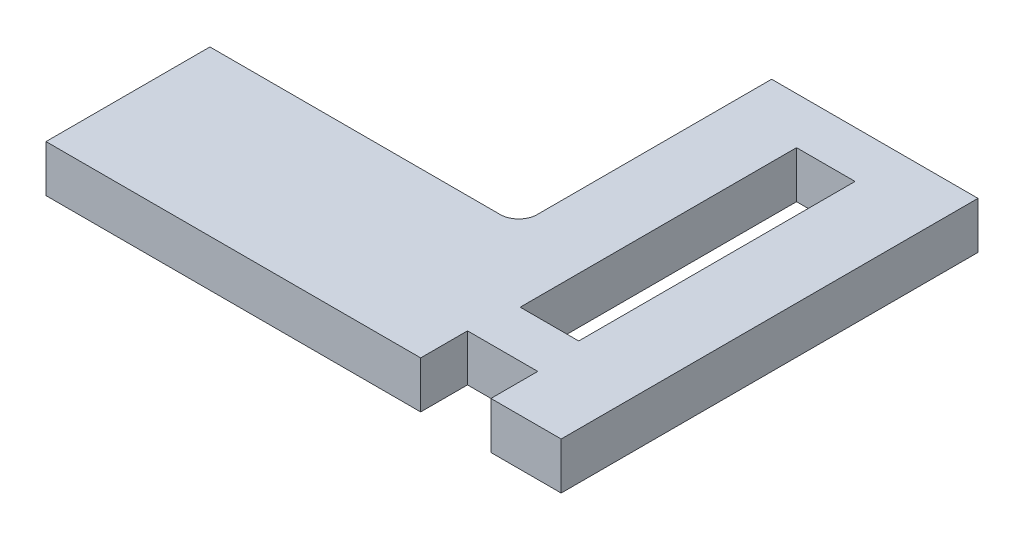
ISO-10303-21;
HEADER;
FILE_DESCRIPTION(('STEP AP214'),'2;1');
FILE_NAME('part.step','',(''),(''),'','','');
FILE_SCHEMA(('AUTOMOTIVE_DESIGN { 1 0 10303 214 1 1 1 1 }'));
ENDSEC;
DATA;
#1=APPLICATION_CONTEXT('core data for automotive mechanical design processes');
#2=APPLICATION_PROTOCOL_DEFINITION('international standard','automotive_design',2000,#1);
#3=PRODUCT_CONTEXT('',#1,'mechanical');
#4=PRODUCT('Part','Part','',(#3));
#5=PRODUCT_RELATED_PRODUCT_CATEGORY('part','',(#4));
#6=PRODUCT_DEFINITION_FORMATION('','',#4);
#7=PRODUCT_DEFINITION_CONTEXT('part definition',#1,'design');
#8=PRODUCT_DEFINITION('design','',#6,#7);
#9=PRODUCT_DEFINITION_SHAPE('','',#8);
#10=(LENGTH_UNIT() NAMED_UNIT(*) SI_UNIT(.MILLI.,.METRE.));
#11=(NAMED_UNIT(*) PLANE_ANGLE_UNIT() SI_UNIT($,.RADIAN.));
#12=(NAMED_UNIT(*) SI_UNIT($,.STERADIAN.) SOLID_ANGLE_UNIT());
#13=UNCERTAINTY_MEASURE_WITH_UNIT(LENGTH_MEASURE(1.E-05),#10,'distance_accuracy_value','');
#14=(GEOMETRIC_REPRESENTATION_CONTEXT(3) GLOBAL_UNCERTAINTY_ASSIGNED_CONTEXT((#13)) GLOBAL_UNIT_ASSIGNED_CONTEXT((#10,
#11,#12)) REPRESENTATION_CONTEXT('',''));
#15=CARTESIAN_POINT('',(0.,0.,0.));
#16=DIRECTION('',(0.,0.,1.));
#17=DIRECTION('',(1.,0.,0.));
#18=AXIS2_PLACEMENT_3D('',#15,#16,#17);
#19=CARTESIAN_POINT('',(157.48,25.4,-98.9));
#20=DIRECTION('',(0.,1.,0.));
#21=DIRECTION('',(0.,0.,1.));
#22=AXIS2_PLACEMENT_3D('',#19,#20,#21);
#23=PLANE('',#22);
#24=DIRECTION('',(0.,0.,-1.));
#25=VECTOR('',#24,1.);
#26=CARTESIAN_POINT('',(0.,25.4,0.));
#27=LINE('',#26,#25);
#28=CARTESIAN_POINT('',(0.,25.4,0.));
#29=VERTEX_POINT('',#28);
#30=CARTESIAN_POINT('',(0.,25.4,-88.9));
#31=VERTEX_POINT('',#30);
#32=EDGE_CURVE('E221',#29,#31,#27,.T.);
#33=ORIENTED_EDGE('',*,*,#32,.F.);
#34=DIRECTION('',(-1.,0.,0.));
#35=VECTOR('',#34,1.);
#36=CARTESIAN_POINT('',(203.2,25.4,0.));
#37=LINE('',#36,#35);
#38=CARTESIAN_POINT('',(203.2,25.4,0.));
#39=VERTEX_POINT('',#38);
#40=EDGE_CURVE('E252',#39,#29,#37,.T.);
#41=ORIENTED_EDGE('',*,*,#40,.F.);
#42=DIRECTION('',(0.,0.,1.));
#43=VECTOR('',#42,1.);
#44=CARTESIAN_POINT('',(203.2,25.4,-25.4));
#45=LINE('',#44,#43);
#46=CARTESIAN_POINT('',(203.2,25.4,-25.4));
#47=VERTEX_POINT('',#46);
#48=EDGE_CURVE('E249',#47,#39,#45,.T.);
#49=ORIENTED_EDGE('',*,*,#48,.F.);
#50=DIRECTION('',(-1.,0.,0.));
#51=VECTOR('',#50,1.);
#52=CARTESIAN_POINT('',(241.3,25.4,-25.4));
#53=LINE('',#52,#51);
#54=CARTESIAN_POINT('',(241.3,25.4,-25.4));
#55=VERTEX_POINT('',#54);
#56=EDGE_CURVE('E246',#55,#47,#53,.T.);
#57=ORIENTED_EDGE('',*,*,#56,.F.);
#58=DIRECTION('',(0.,0.,-1.));
#59=VECTOR('',#58,1.);
#60=CARTESIAN_POINT('',(241.3,25.4,0.));
#61=LINE('',#60,#59);
#62=CARTESIAN_POINT('',(241.3,25.4,0.));
#63=VERTEX_POINT('',#62);
#64=EDGE_CURVE('E243',#63,#55,#61,.T.);
#65=ORIENTED_EDGE('',*,*,#64,.F.);
#66=DIRECTION('',(-1.,0.,0.));
#67=VECTOR('',#66,1.);
#68=CARTESIAN_POINT('',(279.4,25.4,0.));
#69=LINE('',#68,#67);
#70=CARTESIAN_POINT('',(279.4,25.4,0.));
#71=VERTEX_POINT('',#70);
#72=EDGE_CURVE('E240',#71,#63,#69,.T.);
#73=ORIENTED_EDGE('',*,*,#72,.F.);
#74=DIRECTION('',(0.,0.,1.));
#75=VECTOR('',#74,1.);
#76=CARTESIAN_POINT('',(279.4,25.4,-226.06));
#77=LINE('',#76,#75);
#78=CARTESIAN_POINT('',(279.4,25.4,-226.06));
#79=VERTEX_POINT('',#78);
#80=EDGE_CURVE('E237',#79,#71,#77,.T.);
#81=ORIENTED_EDGE('',*,*,#80,.F.);
#82=DIRECTION('',(1.,0.,0.));
#83=VECTOR('',#82,1.);
#84=CARTESIAN_POINT('',(167.48,25.4,-226.06));
#85=LINE('',#84,#83);
#86=CARTESIAN_POINT('',(167.48,25.4,-226.06));
#87=VERTEX_POINT('',#86);
#88=EDGE_CURVE('E234',#87,#79,#85,.T.);
#89=ORIENTED_EDGE('',*,*,#88,.F.);
#90=DIRECTION('',(0.,0.,-1.));
#91=VECTOR('',#90,1.);
#92=CARTESIAN_POINT('',(167.48,25.4,-98.9));
#93=LINE('',#92,#91);
#94=CARTESIAN_POINT('',(167.48,25.4,-98.9));
#95=VERTEX_POINT('',#94);
#96=EDGE_CURVE('E231',#95,#87,#93,.T.);
#97=ORIENTED_EDGE('',*,*,#96,.F.);
#98=CARTESIAN_POINT('',(157.48,25.4,-98.9));
#99=DIRECTION('',(0.,1.,0.));
#100=DIRECTION('',(0.,0.,1.));
#101=AXIS2_PLACEMENT_3D('',#98,#99,#100);
#102=CIRCLE('',#101,10.);
#103=CARTESIAN_POINT('',(157.48,25.4,-88.9));
#104=VERTEX_POINT('',#103);
#105=EDGE_CURVE('E228',#104,#95,#102,.T.);
#106=ORIENTED_EDGE('',*,*,#105,.F.);
#107=DIRECTION('',(1.,0.,0.));
#108=VECTOR('',#107,1.);
#109=CARTESIAN_POINT('',(0.,25.4,-88.9));
#110=LINE('',#109,#108);
#111=EDGE_CURVE('E224',#31,#104,#110,.T.);
#112=ORIENTED_EDGE('',*,*,#111,.F.);
#113=EDGE_LOOP('',(#33,#41,#49,#57,#65,#73,#81,#89,#97,#106,#112));
#114=FACE_BOUND('',#113,.T.);
#115=DIRECTION('',(0.,0.,-1.));
#116=VECTOR('',#115,1.);
#117=CARTESIAN_POINT('',(238.121360741701,25.4,-50.8));
#118=LINE('',#117,#116);
#119=CARTESIAN_POINT('',(238.121360741701,25.4,-50.8));
#120=VERTEX_POINT('',#119);
#121=CARTESIAN_POINT('',(238.121360741701,25.4,-200.66));
#122=VERTEX_POINT('',#121);
#123=EDGE_CURVE('E195',#120,#122,#118,.T.);
#124=ORIENTED_EDGE('',*,*,#123,.F.);
#125=DIRECTION('',(1.,0.,0.));
#126=VECTOR('',#125,1.);
#127=CARTESIAN_POINT('',(206.378639258299,25.4,-50.8));
#128=LINE('',#127,#126);
#129=CARTESIAN_POINT('',(206.378639258299,25.4,-50.8));
#130=VERTEX_POINT('',#129);
#131=EDGE_CURVE('E186',#130,#120,#128,.T.);
#132=ORIENTED_EDGE('',*,*,#131,.F.);
#133=DIRECTION('',(0.,0.,-1.));
#134=VECTOR('',#133,1.);
#135=CARTESIAN_POINT('',(206.378639258299,25.4,-50.8));
#136=LINE('',#135,#134);
#137=CARTESIAN_POINT('',(206.378639258299,25.4,-200.66));
#138=VERTEX_POINT('',#137);
#139=EDGE_CURVE('E206',#130,#138,#136,.T.);
#140=ORIENTED_EDGE('',*,*,#139,.T.);
#141=DIRECTION('',(1.,0.,0.));
#142=VECTOR('',#141,1.);
#143=CARTESIAN_POINT('',(206.378639258299,25.4,-200.66));
#144=LINE('',#143,#142);
#145=EDGE_CURVE('E95',#138,#122,#144,.T.);
#146=ORIENTED_EDGE('',*,*,#145,.T.);
#147=EDGE_LOOP('',(#124,#132,#140,#146));
#148=FACE_BOUND('',#147,.T.);
#149=ADVANCED_FACE('F78',(#114,#148),#23,.T.);
#150=CARTESIAN_POINT('',(157.48,0.,-98.9));
#151=DIRECTION('',(0.,1.,0.));
#152=DIRECTION('',(0.,0.,1.));
#153=AXIS2_PLACEMENT_3D('',#150,#151,#152);
#154=PLANE('',#153);
#155=DIRECTION('',(0.,0.,-1.));
#156=VECTOR('',#155,1.);
#157=CARTESIAN_POINT('',(0.,0.,0.));
#158=LINE('',#157,#156);
#159=CARTESIAN_POINT('',(0.,0.,0.));
#160=VERTEX_POINT('',#159);
#161=CARTESIAN_POINT('',(0.,0.,-88.9));
#162=VERTEX_POINT('',#161);
#163=EDGE_CURVE('E202',#160,#162,#158,.T.);
#164=ORIENTED_EDGE('',*,*,#163,.T.);
#165=DIRECTION('',(1.,0.,0.));
#166=VECTOR('',#165,1.);
#167=CARTESIAN_POINT('',(0.,0.,-88.9));
#168=LINE('',#167,#166);
#169=CARTESIAN_POINT('',(157.48,0.,-88.9));
#170=VERTEX_POINT('',#169);
#171=EDGE_CURVE('E257',#162,#170,#168,.T.);
#172=ORIENTED_EDGE('',*,*,#171,.T.);
#173=CARTESIAN_POINT('',(157.48,0.,-98.9));
#174=DIRECTION('',(0.,1.,0.));
#175=DIRECTION('',(0.,0.,1.));
#176=AXIS2_PLACEMENT_3D('',#173,#174,#175);
#177=CIRCLE('',#176,10.);
#178=CARTESIAN_POINT('',(167.48,0.,-98.9));
#179=VERTEX_POINT('',#178);
#180=EDGE_CURVE('E260',#170,#179,#177,.T.);
#181=ORIENTED_EDGE('',*,*,#180,.T.);
#182=DIRECTION('',(0.,0.,-1.));
#183=VECTOR('',#182,1.);
#184=CARTESIAN_POINT('',(167.48,0.,-98.9));
#185=LINE('',#184,#183);
#186=CARTESIAN_POINT('',(167.48,0.,-226.06));
#187=VERTEX_POINT('',#186);
#188=EDGE_CURVE('E263',#179,#187,#185,.T.);
#189=ORIENTED_EDGE('',*,*,#188,.T.);
#190=DIRECTION('',(1.,0.,0.));
#191=VECTOR('',#190,1.);
#192=CARTESIAN_POINT('',(167.48,0.,-226.06));
#193=LINE('',#192,#191);
#194=CARTESIAN_POINT('',(279.4,0.,-226.06));
#195=VERTEX_POINT('',#194);
#196=EDGE_CURVE('E266',#187,#195,#193,.T.);
#197=ORIENTED_EDGE('',*,*,#196,.T.);
#198=DIRECTION('',(0.,0.,1.));
#199=VECTOR('',#198,1.);
#200=CARTESIAN_POINT('',(279.4,0.,-226.06));
#201=LINE('',#200,#199);
#202=CARTESIAN_POINT('',(279.4,0.,0.));
#203=VERTEX_POINT('',#202);
#204=EDGE_CURVE('E269',#195,#203,#201,.T.);
#205=ORIENTED_EDGE('',*,*,#204,.T.);
#206=DIRECTION('',(-1.,0.,0.));
#207=VECTOR('',#206,1.);
#208=CARTESIAN_POINT('',(279.4,0.,0.));
#209=LINE('',#208,#207);
#210=CARTESIAN_POINT('',(241.3,0.,0.));
#211=VERTEX_POINT('',#210);
#212=EDGE_CURVE('E272',#203,#211,#209,.T.);
#213=ORIENTED_EDGE('',*,*,#212,.T.);
#214=DIRECTION('',(0.,0.,-1.));
#215=VECTOR('',#214,1.);
#216=CARTESIAN_POINT('',(241.3,0.,0.));
#217=LINE('',#216,#215);
#218=CARTESIAN_POINT('',(241.3,0.,-25.4));
#219=VERTEX_POINT('',#218);
#220=EDGE_CURVE('E275',#211,#219,#217,.T.);
#221=ORIENTED_EDGE('',*,*,#220,.T.);
#222=DIRECTION('',(-1.,0.,0.));
#223=VECTOR('',#222,1.);
#224=CARTESIAN_POINT('',(241.3,0.,-25.4));
#225=LINE('',#224,#223);
#226=CARTESIAN_POINT('',(203.2,0.,-25.4));
#227=VERTEX_POINT('',#226);
#228=EDGE_CURVE('E278',#219,#227,#225,.T.);
#229=ORIENTED_EDGE('',*,*,#228,.T.);
#230=DIRECTION('',(0.,0.,1.));
#231=VECTOR('',#230,1.);
#232=CARTESIAN_POINT('',(203.2,0.,-25.4));
#233=LINE('',#232,#231);
#234=CARTESIAN_POINT('',(203.2,0.,0.));
#235=VERTEX_POINT('',#234);
#236=EDGE_CURVE('E281',#227,#235,#233,.T.);
#237=ORIENTED_EDGE('',*,*,#236,.T.);
#238=DIRECTION('',(-1.,0.,0.));
#239=VECTOR('',#238,1.);
#240=CARTESIAN_POINT('',(203.2,0.,0.));
#241=LINE('',#240,#239);
#242=EDGE_CURVE('E225',#235,#160,#241,.T.);
#243=ORIENTED_EDGE('',*,*,#242,.T.);
#244=EDGE_LOOP('',(#164,#172,#181,#189,#197,#205,#213,#221,#229,#237,#243));
#245=FACE_BOUND('',#244,.T.);
#246=DIRECTION('',(1.,0.,0.));
#247=VECTOR('',#246,1.);
#248=CARTESIAN_POINT('',(206.378639258299,0.,-50.8));
#249=LINE('',#248,#247);
#250=CARTESIAN_POINT('',(206.378639258299,0.,-50.8));
#251=VERTEX_POINT('',#250);
#252=CARTESIAN_POINT('',(238.121360741701,0.,-50.8));
#253=VERTEX_POINT('',#252);
#254=EDGE_CURVE('E103',#251,#253,#249,.T.);
#255=ORIENTED_EDGE('',*,*,#254,.T.);
#256=DIRECTION('',(0.,0.,-1.));
#257=VECTOR('',#256,1.);
#258=CARTESIAN_POINT('',(238.121360741701,0.,-50.8));
#259=LINE('',#258,#257);
#260=CARTESIAN_POINT('',(238.121360741701,0.,-200.66));
#261=VERTEX_POINT('',#260);
#262=EDGE_CURVE('E201',#253,#261,#259,.T.);
#263=ORIENTED_EDGE('',*,*,#262,.T.);
#264=DIRECTION('',(1.,0.,0.));
#265=VECTOR('',#264,1.);
#266=CARTESIAN_POINT('',(206.378639258299,0.,-200.66));
#267=LINE('',#266,#265);
#268=CARTESIAN_POINT('',(206.378639258299,0.,-200.66));
#269=VERTEX_POINT('',#268);
#270=EDGE_CURVE('E212',#269,#261,#267,.T.);
#271=ORIENTED_EDGE('',*,*,#270,.F.);
#272=DIRECTION('',(0.,0.,-1.));
#273=VECTOR('',#272,1.);
#274=CARTESIAN_POINT('',(206.378639258299,0.,-50.8));
#275=LINE('',#274,#273);
#276=EDGE_CURVE('E196',#251,#269,#275,.T.);
#277=ORIENTED_EDGE('',*,*,#276,.F.);
#278=EDGE_LOOP('',(#255,#263,#271,#277));
#279=FACE_BOUND('',#278,.T.);
#280=ADVANCED_FACE('F310',(#245,#279),#154,.F.);
#281=CARTESIAN_POINT('',(0.,25.4,0.));
#282=DIRECTION('',(-1.,0.,0.));
#283=DIRECTION('',(0.,0.,1.));
#284=AXIS2_PLACEMENT_3D('',#281,#282,#283);
#285=PLANE('',#284);
#286=ORIENTED_EDGE('',*,*,#163,.F.);
#287=DIRECTION('',(0.,-1.,0.));
#288=VECTOR('',#287,1.);
#289=CARTESIAN_POINT('',(0.,25.4,0.));
#290=LINE('',#289,#288);
#291=EDGE_CURVE('E12',#29,#160,#290,.T.);
#292=ORIENTED_EDGE('',*,*,#291,.F.);
#293=ORIENTED_EDGE('',*,*,#32,.T.);
#294=DIRECTION('',(0.,-1.,0.));
#295=VECTOR('',#294,1.);
#296=CARTESIAN_POINT('',(0.,25.4,-88.9));
#297=LINE('',#296,#295);
#298=EDGE_CURVE('E82',#31,#162,#297,.T.);
#299=ORIENTED_EDGE('',*,*,#298,.T.);
#300=EDGE_LOOP('',(#286,#292,#293,#299));
#301=FACE_BOUND('',#300,.T.);
#302=ADVANCED_FACE('F80',(#301),#285,.T.);
#303=CARTESIAN_POINT('',(203.2,25.4,0.));
#304=DIRECTION('',(0.,0.,1.));
#305=DIRECTION('',(1.,0.,0.));
#306=AXIS2_PLACEMENT_3D('',#303,#304,#305);
#307=PLANE('',#306);
#308=ORIENTED_EDGE('',*,*,#242,.F.);
#309=DIRECTION('',(0.,-1.,0.));
#310=VECTOR('',#309,1.);
#311=CARTESIAN_POINT('',(203.2,25.4,0.));
#312=LINE('',#311,#310);
#313=EDGE_CURVE('E87',#39,#235,#312,.T.);
#314=ORIENTED_EDGE('',*,*,#313,.F.);
#315=ORIENTED_EDGE('',*,*,#40,.T.);
#316=ORIENTED_EDGE('',*,*,#291,.T.);
#317=EDGE_LOOP('',(#308,#314,#315,#316));
#318=FACE_BOUND('',#317,.T.);
#319=ADVANCED_FACE('F315',(#318),#307,.T.);
#320=CARTESIAN_POINT('',(203.2,25.4,-25.4));
#321=DIRECTION('',(1.,0.,0.));
#322=DIRECTION('',(0.,0.,-1.));
#323=AXIS2_PLACEMENT_3D('',#320,#321,#322);
#324=PLANE('',#323);
#325=ORIENTED_EDGE('',*,*,#236,.F.);
#326=DIRECTION('',(0.,-1.,0.));
#327=VECTOR('',#326,1.);
#328=CARTESIAN_POINT('',(203.2,25.4,-25.4));
#329=LINE('',#328,#327);
#330=EDGE_CURVE('E287',#47,#227,#329,.T.);
#331=ORIENTED_EDGE('',*,*,#330,.F.);
#332=ORIENTED_EDGE('',*,*,#48,.T.);
#333=ORIENTED_EDGE('',*,*,#313,.T.);
#334=EDGE_LOOP('',(#325,#331,#332,#333));
#335=FACE_BOUND('',#334,.T.);
#336=ADVANCED_FACE('F347',(#335),#324,.T.);
#337=CARTESIAN_POINT('',(241.3,25.4,-25.4));
#338=DIRECTION('',(0.,0.,1.));
#339=DIRECTION('',(1.,0.,0.));
#340=AXIS2_PLACEMENT_3D('',#337,#338,#339);
#341=PLANE('',#340);
#342=ORIENTED_EDGE('',*,*,#228,.F.);
#343=DIRECTION('',(0.,-1.,0.));
#344=VECTOR('',#343,1.);
#345=CARTESIAN_POINT('',(241.3,25.4,-25.4));
#346=LINE('',#345,#344);
#347=EDGE_CURVE('E289',#55,#219,#346,.T.);
#348=ORIENTED_EDGE('',*,*,#347,.F.);
#349=ORIENTED_EDGE('',*,*,#56,.T.);
#350=ORIENTED_EDGE('',*,*,#330,.T.);
#351=EDGE_LOOP('',(#342,#348,#349,#350));
#352=FACE_BOUND('',#351,.T.);
#353=ADVANCED_FACE('F345',(#352),#341,.T.);
#354=CARTESIAN_POINT('',(241.3,25.4,0.));
#355=DIRECTION('',(-1.,0.,0.));
#356=DIRECTION('',(0.,0.,1.));
#357=AXIS2_PLACEMENT_3D('',#354,#355,#356);
#358=PLANE('',#357);
#359=ORIENTED_EDGE('',*,*,#220,.F.);
#360=DIRECTION('',(0.,-1.,0.));
#361=VECTOR('',#360,1.);
#362=CARTESIAN_POINT('',(241.3,25.4,0.));
#363=LINE('',#362,#361);
#364=EDGE_CURVE('E291',#63,#211,#363,.T.);
#365=ORIENTED_EDGE('',*,*,#364,.F.);
#366=ORIENTED_EDGE('',*,*,#64,.T.);
#367=ORIENTED_EDGE('',*,*,#347,.T.);
#368=EDGE_LOOP('',(#359,#365,#366,#367));
#369=FACE_BOUND('',#368,.T.);
#370=ADVANCED_FACE('F341',(#369),#358,.T.);
#371=CARTESIAN_POINT('',(279.4,25.4,0.));
#372=DIRECTION('',(0.,0.,1.));
#373=DIRECTION('',(1.,0.,0.));
#374=AXIS2_PLACEMENT_3D('',#371,#372,#373);
#375=PLANE('',#374);
#376=ORIENTED_EDGE('',*,*,#212,.F.);
#377=DIRECTION('',(0.,-1.,0.));
#378=VECTOR('',#377,1.);
#379=CARTESIAN_POINT('',(279.4,25.4,0.));
#380=LINE('',#379,#378);
#381=EDGE_CURVE('E293',#71,#203,#380,.T.);
#382=ORIENTED_EDGE('',*,*,#381,.F.);
#383=ORIENTED_EDGE('',*,*,#72,.T.);
#384=ORIENTED_EDGE('',*,*,#364,.T.);
#385=EDGE_LOOP('',(#376,#382,#383,#384));
#386=FACE_BOUND('',#385,.T.);
#387=ADVANCED_FACE('F337',(#386),#375,.T.);
#388=CARTESIAN_POINT('',(279.4,25.4,-226.06));
#389=DIRECTION('',(1.,0.,0.));
#390=DIRECTION('',(0.,0.,-1.));
#391=AXIS2_PLACEMENT_3D('',#388,#389,#390);
#392=PLANE('',#391);
#393=ORIENTED_EDGE('',*,*,#204,.F.);
#394=DIRECTION('',(0.,-1.,0.));
#395=VECTOR('',#394,1.);
#396=CARTESIAN_POINT('',(279.4,25.4,-226.06));
#397=LINE('',#396,#395);
#398=EDGE_CURVE('E295',#79,#195,#397,.T.);
#399=ORIENTED_EDGE('',*,*,#398,.F.);
#400=ORIENTED_EDGE('',*,*,#80,.T.);
#401=ORIENTED_EDGE('',*,*,#381,.T.);
#402=EDGE_LOOP('',(#393,#399,#400,#401));
#403=FACE_BOUND('',#402,.T.);
#404=ADVANCED_FACE('F333',(#403),#392,.T.);
#405=CARTESIAN_POINT('',(167.48,25.4,-226.06));
#406=DIRECTION('',(0.,0.,-1.));
#407=DIRECTION('',(-1.,0.,0.));
#408=AXIS2_PLACEMENT_3D('',#405,#406,#407);
#409=PLANE('',#408);
#410=ORIENTED_EDGE('',*,*,#196,.F.);
#411=DIRECTION('',(0.,-1.,0.));
#412=VECTOR('',#411,1.);
#413=CARTESIAN_POINT('',(167.48,25.4,-226.06));
#414=LINE('',#413,#412);
#415=EDGE_CURVE('E297',#87,#187,#414,.T.);
#416=ORIENTED_EDGE('',*,*,#415,.F.);
#417=ORIENTED_EDGE('',*,*,#88,.T.);
#418=ORIENTED_EDGE('',*,*,#398,.T.);
#419=EDGE_LOOP('',(#410,#416,#417,#418));
#420=FACE_BOUND('',#419,.T.);
#421=ADVANCED_FACE('F329',(#420),#409,.T.);
#422=CARTESIAN_POINT('',(167.48,25.4,-98.9));
#423=DIRECTION('',(-1.,0.,0.));
#424=DIRECTION('',(0.,0.,1.));
#425=AXIS2_PLACEMENT_3D('',#422,#423,#424);
#426=PLANE('',#425);
#427=ORIENTED_EDGE('',*,*,#188,.F.);
#428=DIRECTION('',(0.,-1.,0.));
#429=VECTOR('',#428,1.);
#430=CARTESIAN_POINT('',(167.48,25.4,-98.9));
#431=LINE('',#430,#429);
#432=EDGE_CURVE('E299',#95,#179,#431,.T.);
#433=ORIENTED_EDGE('',*,*,#432,.F.);
#434=ORIENTED_EDGE('',*,*,#96,.T.);
#435=ORIENTED_EDGE('',*,*,#415,.T.);
#436=EDGE_LOOP('',(#427,#433,#434,#435));
#437=FACE_BOUND('',#436,.T.);
#438=ADVANCED_FACE('F327',(#437),#426,.T.);
#439=CARTESIAN_POINT('',(157.48,25.4,-98.9));
#440=DIRECTION('',(0.,-1.,0.));
#441=DIRECTION('',(0.,0.,-1.));
#442=AXIS2_PLACEMENT_3D('',#439,#440,#441);
#443=CYLINDRICAL_SURFACE('',#442,10.);
#444=ORIENTED_EDGE('',*,*,#180,.F.);
#445=DIRECTION('',(0.,-1.,0.));
#446=VECTOR('',#445,1.);
#447=CARTESIAN_POINT('',(157.48,25.4,-88.9));
#448=LINE('',#447,#446);
#449=EDGE_CURVE('E300',#104,#170,#448,.T.);
#450=ORIENTED_EDGE('',*,*,#449,.F.);
#451=ORIENTED_EDGE('',*,*,#105,.T.);
#452=ORIENTED_EDGE('',*,*,#432,.T.);
#453=EDGE_LOOP('',(#444,#450,#451,#452));
#454=FACE_BOUND('',#453,.T.);
#455=ADVANCED_FACE('F323',(#454),#443,.F.);
#456=CARTESIAN_POINT('',(0.,25.4,-88.9));
#457=DIRECTION('',(0.,0.,-1.));
#458=DIRECTION('',(-1.,0.,0.));
#459=AXIS2_PLACEMENT_3D('',#456,#457,#458);
#460=PLANE('',#459);
#461=ORIENTED_EDGE('',*,*,#171,.F.);
#462=ORIENTED_EDGE('',*,*,#298,.F.);
#463=ORIENTED_EDGE('',*,*,#111,.T.);
#464=ORIENTED_EDGE('',*,*,#449,.T.);
#465=EDGE_LOOP('',(#461,#462,#463,#464));
#466=FACE_BOUND('',#465,.T.);
#467=ADVANCED_FACE('F308',(#466),#460,.T.);
#468=CARTESIAN_POINT('',(206.378639258299,25.4,-50.8));
#469=DIRECTION('',(0.,0.,-1.));
#470=DIRECTION('',(-1.,0.,0.));
#471=AXIS2_PLACEMENT_3D('',#468,#469,#470);
#472=PLANE('',#471);
#473=ORIENTED_EDGE('',*,*,#254,.F.);
#474=DIRECTION('',(0.,-1.,0.));
#475=VECTOR('',#474,1.);
#476=CARTESIAN_POINT('',(206.378639258299,25.4,-50.8));
#477=LINE('',#476,#475);
#478=EDGE_CURVE('E190',#130,#251,#477,.T.);
#479=ORIENTED_EDGE('',*,*,#478,.F.);
#480=ORIENTED_EDGE('',*,*,#131,.T.);
#481=DIRECTION('',(0.,-1.,0.));
#482=VECTOR('',#481,1.);
#483=CARTESIAN_POINT('',(238.121360741701,25.4,-50.8));
#484=LINE('',#483,#482);
#485=EDGE_CURVE('E189',#120,#253,#484,.T.);
#486=ORIENTED_EDGE('',*,*,#485,.T.);
#487=EDGE_LOOP('',(#473,#479,#480,#486));
#488=FACE_BOUND('',#487,.T.);
#489=ADVANCED_FACE('F188',(#488),#472,.T.);
#490=CARTESIAN_POINT('',(238.121360741701,25.4,-50.8));
#491=DIRECTION('',(-1.,0.,0.));
#492=DIRECTION('',(0.,0.,1.));
#493=AXIS2_PLACEMENT_3D('',#490,#491,#492);
#494=PLANE('',#493);
#495=ORIENTED_EDGE('',*,*,#262,.F.);
#496=ORIENTED_EDGE('',*,*,#485,.F.);
#497=ORIENTED_EDGE('',*,*,#123,.T.);
#498=DIRECTION('',(0.,-1.,0.));
#499=VECTOR('',#498,1.);
#500=CARTESIAN_POINT('',(238.121360741701,25.4,-200.66));
#501=LINE('',#500,#499);
#502=EDGE_CURVE('E203',#122,#261,#501,.T.);
#503=ORIENTED_EDGE('',*,*,#502,.T.);
#504=EDGE_LOOP('',(#495,#496,#497,#503));
#505=FACE_BOUND('',#504,.T.);
#506=ADVANCED_FACE('F199',(#505),#494,.T.);
#507=CARTESIAN_POINT('',(206.378639258299,25.4,-200.66));
#508=DIRECTION('',(0.,0.,-1.));
#509=DIRECTION('',(-1.,0.,0.));
#510=AXIS2_PLACEMENT_3D('',#507,#508,#509);
#511=PLANE('',#510);
#512=ORIENTED_EDGE('',*,*,#270,.T.);
#513=ORIENTED_EDGE('',*,*,#502,.F.);
#514=ORIENTED_EDGE('',*,*,#145,.F.);
#515=DIRECTION('',(0.,-1.,0.));
#516=VECTOR('',#515,1.);
#517=CARTESIAN_POINT('',(206.378639258299,25.4,-200.66));
#518=LINE('',#517,#516);
#519=EDGE_CURVE('E218',#138,#269,#518,.T.);
#520=ORIENTED_EDGE('',*,*,#519,.T.);
#521=EDGE_LOOP('',(#512,#513,#514,#520));
#522=FACE_BOUND('',#521,.T.);
#523=ADVANCED_FACE('F367',(#522),#511,.F.);
#524=CARTESIAN_POINT('',(206.378639258299,25.4,-50.8));
#525=DIRECTION('',(-1.,0.,0.));
#526=DIRECTION('',(0.,0.,1.));
#527=AXIS2_PLACEMENT_3D('',#524,#525,#526);
#528=PLANE('',#527);
#529=ORIENTED_EDGE('',*,*,#276,.T.);
#530=ORIENTED_EDGE('',*,*,#519,.F.);
#531=ORIENTED_EDGE('',*,*,#139,.F.);
#532=ORIENTED_EDGE('',*,*,#478,.T.);
#533=EDGE_LOOP('',(#529,#530,#531,#532));
#534=FACE_BOUND('',#533,.T.);
#535=ADVANCED_FACE('F370',(#534),#528,.F.);
#536=CLOSED_SHELL('',(#149,#280,#302,#319,#336,#353,#370,#387,#404,#421,#438,#455,#467,#489,
#506,#523,#535));
#537=MANIFOLD_SOLID_BREP('B2',#536);
#538=ADVANCED_BREP_SHAPE_REPRESENTATION('',(#18,#537),#14);
#539=SHAPE_DEFINITION_REPRESENTATION(#9,#538);
ENDSEC;
END-ISO-10303-21;
